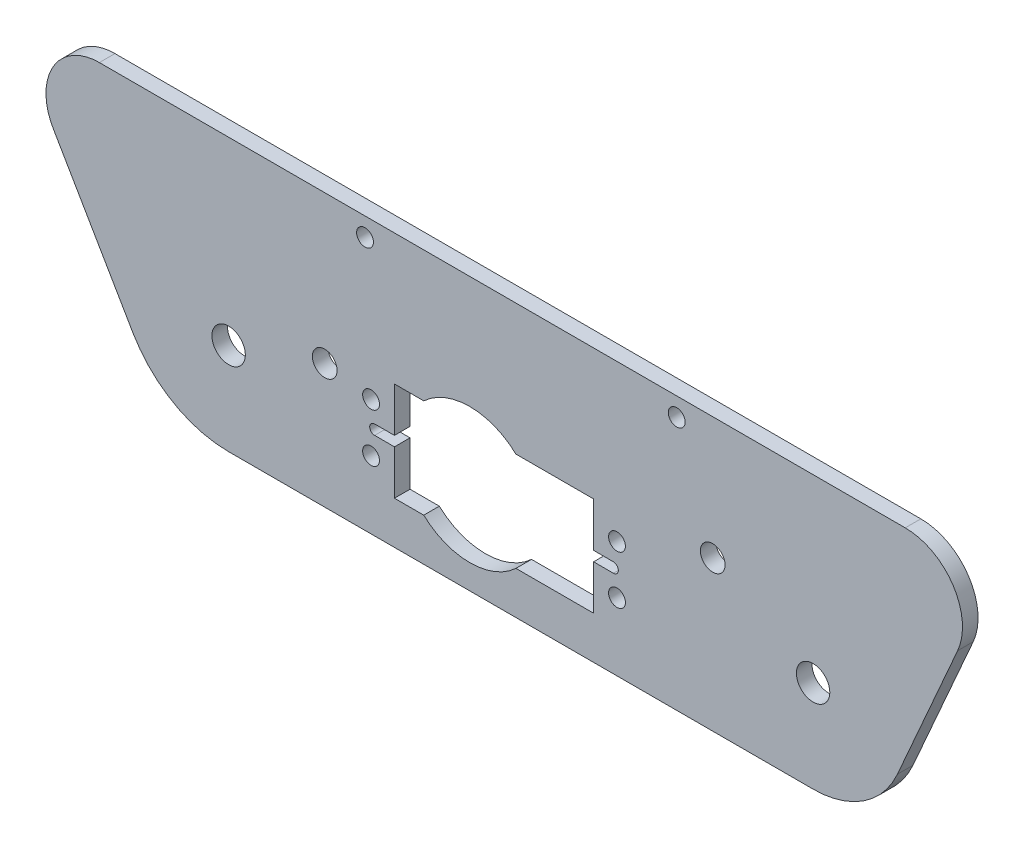
ISO-10303-21;
HEADER;
FILE_DESCRIPTION(('STEP AP214'),'2;1');
FILE_NAME('part.step','',(''),(''),'','','');
FILE_SCHEMA(('AUTOMOTIVE_DESIGN { 1 0 10303 214 1 1 1 1 }'));
ENDSEC;
DATA;
#1=APPLICATION_CONTEXT('core data for automotive mechanical design processes');
#2=APPLICATION_PROTOCOL_DEFINITION('international standard','automotive_design',2000,#1);
#3=PRODUCT_CONTEXT('',#1,'mechanical');
#4=PRODUCT('Part','Part','',(#3));
#5=PRODUCT_RELATED_PRODUCT_CATEGORY('part','',(#4));
#6=PRODUCT_DEFINITION_FORMATION('','',#4);
#7=PRODUCT_DEFINITION_CONTEXT('part definition',#1,'design');
#8=PRODUCT_DEFINITION('design','',#6,#7);
#9=PRODUCT_DEFINITION_SHAPE('','',#8);
#10=(LENGTH_UNIT() NAMED_UNIT(*) SI_UNIT(.MILLI.,.METRE.));
#11=(NAMED_UNIT(*) PLANE_ANGLE_UNIT() SI_UNIT($,.RADIAN.));
#12=(NAMED_UNIT(*) SI_UNIT($,.STERADIAN.) SOLID_ANGLE_UNIT());
#13=UNCERTAINTY_MEASURE_WITH_UNIT(LENGTH_MEASURE(1.E-05),#10,'distance_accuracy_value','');
#14=(GEOMETRIC_REPRESENTATION_CONTEXT(3) GLOBAL_UNCERTAINTY_ASSIGNED_CONTEXT((#13)) GLOBAL_UNIT_ASSIGNED_CONTEXT((#10,
#11,#12)) REPRESENTATION_CONTEXT('',''));
#15=CARTESIAN_POINT('',(0.,0.,0.));
#16=DIRECTION('',(0.,0.,1.));
#17=DIRECTION('',(1.,0.,0.));
#18=AXIS2_PLACEMENT_3D('',#15,#16,#17);
#19=CARTESIAN_POINT('',(74.943999972,29.06776,3.2004));
#20=DIRECTION('',(0.,1.,0.));
#21=DIRECTION('',(-1.,0.,0.));
#22=AXIS2_PLACEMENT_3D('',#19,#20,#21);
#23=PLANE('',#22);
#24=DIRECTION('',(1.,0.,0.));
#25=VECTOR('',#24,1.);
#26=CARTESIAN_POINT('',(74.943999972,29.06776,3.2004));
#27=LINE('',#26,#25);
#28=CARTESIAN_POINT('',(58.9943124104193,29.06776,3.2004));
#29=VERTEX_POINT('',#28);
#30=CARTESIAN_POINT('',(74.943999972,29.06776,3.2004));
#31=VERTEX_POINT('',#30);
#32=EDGE_CURVE('E236',#29,#31,#27,.T.);
#33=ORIENTED_EDGE('',*,*,#32,.F.);
#34=DIRECTION('',(0.,0.,-1.));
#35=VECTOR('',#34,1.);
#36=CARTESIAN_POINT('',(58.9943124104193,29.06776,42.4736794049101));
#37=LINE('',#36,#35);
#38=CARTESIAN_POINT('',(58.9943124104193,29.06776,0.));
#39=VERTEX_POINT('',#38);
#40=EDGE_CURVE('E201',#29,#39,#37,.T.);
#41=ORIENTED_EDGE('',*,*,#40,.T.);
#42=DIRECTION('',(1.,0.,0.));
#43=VECTOR('',#42,1.);
#44=CARTESIAN_POINT('',(74.943999972,29.06776,0.));
#45=LINE('',#44,#43);
#46=CARTESIAN_POINT('',(74.943999972,29.06776,0.));
#47=VERTEX_POINT('',#46);
#48=EDGE_CURVE('E211',#39,#47,#45,.T.);
#49=ORIENTED_EDGE('',*,*,#48,.T.);
#50=DIRECTION('',(0.,0.,-1.));
#51=VECTOR('',#50,1.);
#52=CARTESIAN_POINT('',(74.943999972,29.06776,3.2004));
#53=LINE('',#52,#51);
#54=EDGE_CURVE('E245',#31,#47,#53,.T.);
#55=ORIENTED_EDGE('',*,*,#54,.F.);
#56=EDGE_LOOP('',(#33,#41,#49,#55));
#57=FACE_BOUND('',#56,.T.);
#58=ADVANCED_FACE('F34',(#57),#23,.F.);
#59=CARTESIAN_POINT('',(74.943999972,8.74776000000003,3.2004));
#60=DIRECTION('',(0.,-1.,0.));
#61=DIRECTION('',(1.,0.,0.));
#62=AXIS2_PLACEMENT_3D('',#59,#60,#61);
#63=PLANE('',#62);
#64=DIRECTION('',(-1.,0.,0.));
#65=VECTOR('',#64,1.);
#66=CARTESIAN_POINT('',(74.943999972,8.74776000000003,3.2004));
#67=LINE('',#66,#65);
#68=CARTESIAN_POINT('',(40.0656875895807,8.74776000000002,3.2004));
#69=VERTEX_POINT('',#68);
#70=CARTESIAN_POINT('',(34.049999972,8.74776000000002,3.2004));
#71=VERTEX_POINT('',#70);
#72=EDGE_CURVE('E356',#69,#71,#67,.T.);
#73=ORIENTED_EDGE('',*,*,#72,.F.);
#74=DIRECTION('',(0.,0.,-1.));
#75=VECTOR('',#74,1.);
#76=CARTESIAN_POINT('',(40.0656875895807,8.74776000000002,42.4736794049101));
#77=LINE('',#76,#75);
#78=CARTESIAN_POINT('',(40.0656875895807,8.74776000000002,0.));
#79=VERTEX_POINT('',#78);
#80=EDGE_CURVE('E11',#69,#79,#77,.T.);
#81=ORIENTED_EDGE('',*,*,#80,.T.);
#82=DIRECTION('',(-1.,0.,0.));
#83=VECTOR('',#82,1.);
#84=CARTESIAN_POINT('',(74.943999972,8.74776000000003,0.));
#85=LINE('',#84,#83);
#86=CARTESIAN_POINT('',(34.049999972,8.74776000000002,0.));
#87=VERTEX_POINT('',#86);
#88=EDGE_CURVE('E228',#79,#87,#85,.T.);
#89=ORIENTED_EDGE('',*,*,#88,.T.);
#90=DIRECTION('',(0.,0.,-1.));
#91=VECTOR('',#90,1.);
#92=CARTESIAN_POINT('',(34.049999972,8.74776000000002,3.2004));
#93=LINE('',#92,#91);
#94=EDGE_CURVE('E239',#71,#87,#93,.T.);
#95=ORIENTED_EDGE('',*,*,#94,.F.);
#96=EDGE_LOOP('',(#73,#81,#89,#95));
#97=FACE_BOUND('',#96,.T.);
#98=ADVANCED_FACE('F460',(#97),#63,.F.);
#99=CARTESIAN_POINT('',(34.049999972,29.06776,3.2004));
#100=DIRECTION('',(-1.,0.,0.));
#101=DIRECTION('',(0.,-1.,0.));
#102=AXIS2_PLACEMENT_3D('',#99,#100,#101);
#103=PLANE('',#102);
#104=DIRECTION('',(0.,1.,0.));
#105=VECTOR('',#104,1.);
#106=CARTESIAN_POINT('',(34.049999972,29.06776,0.));
#107=LINE('',#106,#105);
#108=CARTESIAN_POINT('',(34.049999972,17.89176,0.));
#109=VERTEX_POINT('',#108);
#110=EDGE_CURVE('E233',#87,#109,#107,.T.);
#111=ORIENTED_EDGE('',*,*,#110,.T.);
#112=DIRECTION('',(0.,0.,1.));
#113=VECTOR('',#112,1.);
#114=CARTESIAN_POINT('',(34.049999972,17.89176,-5.47132744404866));
#115=LINE('',#114,#113);
#116=CARTESIAN_POINT('',(34.049999972,17.89176,3.2004));
#117=VERTEX_POINT('',#116);
#118=EDGE_CURVE('E420',#109,#117,#115,.T.);
#119=ORIENTED_EDGE('',*,*,#118,.T.);
#120=DIRECTION('',(0.,1.,0.));
#121=VECTOR('',#120,1.);
#122=CARTESIAN_POINT('',(34.049999972,29.06776,3.2004));
#123=LINE('',#122,#121);
#124=EDGE_CURVE('E224',#71,#117,#123,.T.);
#125=ORIENTED_EDGE('',*,*,#124,.F.);
#126=ORIENTED_EDGE('',*,*,#94,.T.);
#127=EDGE_LOOP('',(#111,#119,#125,#126));
#128=FACE_BOUND('',#127,.T.);
#129=ADVANCED_FACE('F467',(#128),#103,.F.);
#130=CARTESIAN_POINT('',(74.943999972,29.06776,3.2004));
#131=DIRECTION('',(1.,0.,0.));
#132=DIRECTION('',(0.,0.,-1.));
#133=AXIS2_PLACEMENT_3D('',#130,#131,#132);
#134=PLANE('',#133);
#135=DIRECTION('',(0.,-1.,0.));
#136=VECTOR('',#135,1.);
#137=CARTESIAN_POINT('',(74.943999972,29.06776,0.));
#138=LINE('',#137,#136);
#139=CARTESIAN_POINT('',(74.943999972,19.92376,0.));
#140=VERTEX_POINT('',#139);
#141=EDGE_CURVE('E220',#47,#140,#138,.T.);
#142=ORIENTED_EDGE('',*,*,#141,.T.);
#143=DIRECTION('',(0.,0.,1.));
#144=VECTOR('',#143,1.);
#145=CARTESIAN_POINT('',(74.943999972,19.92376,-5.47132744404866));
#146=LINE('',#145,#144);
#147=CARTESIAN_POINT('',(74.943999972,19.92376,3.2004));
#148=VERTEX_POINT('',#147);
#149=EDGE_CURVE('E398',#140,#148,#146,.T.);
#150=ORIENTED_EDGE('',*,*,#149,.T.);
#151=DIRECTION('',(0.,-1.,0.));
#152=VECTOR('',#151,1.);
#153=CARTESIAN_POINT('',(74.943999972,29.06776,3.2004));
#154=LINE('',#153,#152);
#155=EDGE_CURVE('E357',#31,#148,#154,.T.);
#156=ORIENTED_EDGE('',*,*,#155,.F.);
#157=ORIENTED_EDGE('',*,*,#54,.T.);
#158=EDGE_LOOP('',(#142,#150,#156,#157));
#159=FACE_BOUND('',#158,.T.);
#160=ADVANCED_FACE('F438',(#159),#134,.F.);
#161=CARTESIAN_POINT('',(-26.5432576602224,44.962934382464,3.2004));
#162=DIRECTION('',(0.,0.,1.));
#163=DIRECTION('',(1.,0.,0.));
#164=AXIS2_PLACEMENT_3D('',#161,#162,#163);
#165=PLANE('',#164);
#166=CARTESIAN_POINT('',(49.53,18.90776,3.2004));
#167=DIRECTION('',(0.,0.,1.));
#168=DIRECTION('',(1.,0.,0.));
#169=AXIS2_PLACEMENT_3D('',#166,#167,#168);
#170=CIRCLE('',#169,13.8852010933229);
#171=CARTESIAN_POINT('',(40.0656875895807,29.06776,3.2004));
#172=VERTEX_POINT('',#171);
#173=EDGE_CURVE('E49',#172,#29,#170,.F.);
#174=ORIENTED_EDGE('',*,*,#173,.T.);
#175=ORIENTED_EDGE('',*,*,#32,.T.);
#176=ORIENTED_EDGE('',*,*,#155,.T.);
#177=DIRECTION('',(-1.,0.,0.));
#178=VECTOR('',#177,1.);
#179=CARTESIAN_POINT('',(74.943999972,19.92376,3.2004));
#180=LINE('',#179,#178);
#181=CARTESIAN_POINT('',(79.007999972,19.92376,3.2004));
#182=VERTEX_POINT('',#181);
#183=EDGE_CURVE('E394',#182,#148,#180,.T.);
#184=ORIENTED_EDGE('',*,*,#183,.F.);
#185=CARTESIAN_POINT('',(79.007999972,18.90776,3.2004));
#186=DIRECTION('',(0.,0.,1.));
#187=DIRECTION('',(-1.,0.,0.));
#188=AXIS2_PLACEMENT_3D('',#185,#186,#187);
#189=CIRCLE('',#188,1.016);
#190=CARTESIAN_POINT('',(79.007999972,17.89176,3.2004));
#191=VERTEX_POINT('',#190);
#192=EDGE_CURVE('E403',#191,#182,#189,.T.);
#193=ORIENTED_EDGE('',*,*,#192,.F.);
#194=DIRECTION('',(1.,0.,0.));
#195=VECTOR('',#194,1.);
#196=CARTESIAN_POINT('',(74.943999972,17.89176,3.2004));
#197=LINE('',#196,#195);
#198=CARTESIAN_POINT('',(74.943999972,17.89176,3.2004));
#199=VERTEX_POINT('',#198);
#200=EDGE_CURVE('E406',#199,#191,#197,.T.);
#201=ORIENTED_EDGE('',*,*,#200,.F.);
#202=CARTESIAN_POINT('',(74.943999972,8.74776000000004,3.2004));
#203=VERTEX_POINT('',#202);
#204=EDGE_CURVE('E354',#199,#203,#154,.T.);
#205=ORIENTED_EDGE('',*,*,#204,.T.);
#206=CARTESIAN_POINT('',(58.9943124104193,8.74776000000002,3.2004));
#207=VERTEX_POINT('',#206);
#208=EDGE_CURVE('E344',#203,#207,#67,.T.);
#209=ORIENTED_EDGE('',*,*,#208,.T.);
#210=EDGE_CURVE('E57',#207,#69,#170,.F.);
#211=ORIENTED_EDGE('',*,*,#210,.T.);
#212=ORIENTED_EDGE('',*,*,#72,.T.);
#213=ORIENTED_EDGE('',*,*,#124,.T.);
#214=DIRECTION('',(1.,0.,0.));
#215=VECTOR('',#214,1.);
#216=CARTESIAN_POINT('',(29.985999972,17.89176,3.2004));
#217=LINE('',#216,#215);
#218=CARTESIAN_POINT('',(29.985999972,17.89176,3.2004));
#219=VERTEX_POINT('',#218);
#220=EDGE_CURVE('E416',#219,#117,#217,.T.);
#221=ORIENTED_EDGE('',*,*,#220,.F.);
#222=CARTESIAN_POINT('',(29.985999972,18.90776,3.2004));
#223=DIRECTION('',(0.,0.,1.));
#224=DIRECTION('',(1.,0.,0.));
#225=AXIS2_PLACEMENT_3D('',#222,#223,#224);
#226=CIRCLE('',#225,1.016);
#227=CARTESIAN_POINT('',(29.985999972,19.92376,3.2004));
#228=VERTEX_POINT('',#227);
#229=EDGE_CURVE('E425',#228,#219,#226,.T.);
#230=ORIENTED_EDGE('',*,*,#229,.F.);
#231=DIRECTION('',(-1.,0.,0.));
#232=VECTOR('',#231,1.);
#233=CARTESIAN_POINT('',(29.985999972,19.92376,3.2004));
#234=LINE('',#233,#232);
#235=CARTESIAN_POINT('',(34.049999972,19.92376,3.2004));
#236=VERTEX_POINT('',#235);
#237=EDGE_CURVE('E389',#236,#228,#234,.T.);
#238=ORIENTED_EDGE('',*,*,#237,.F.);
#239=CARTESIAN_POINT('',(34.049999972,29.06776,3.2004));
#240=VERTEX_POINT('',#239);
#241=EDGE_CURVE('E355',#236,#240,#123,.T.);
#242=ORIENTED_EDGE('',*,*,#241,.T.);
#243=EDGE_CURVE('E361',#240,#172,#27,.T.);
#244=ORIENTED_EDGE('',*,*,#243,.T.);
#245=EDGE_LOOP('',(#174,#175,#176,#184,#193,#201,#205,#209,#211,#212,#213,#221,#230,#238,#242,#244));
#246=FACE_BOUND('',#245,.T.);
#247=CARTESIAN_POINT('',(79.746999972,23.90776,3.2004));
#248=DIRECTION('',(0.,0.,-1.));
#249=DIRECTION('',(-1.,0.,0.));
#250=AXIS2_PLACEMENT_3D('',#247,#248,#249);
#251=CIRCLE('',#250,1.72719999999997);
#252=CARTESIAN_POINT('',(78.019799972,23.90776,3.2004));
#253=VERTEX_POINT('',#252);
#254=EDGE_CURVE('E222',#253,#253,#251,.T.);
#255=ORIENTED_EDGE('',*,*,#254,.T.);
#256=EDGE_LOOP('',(#255));
#257=FACE_BOUND('',#256,.T.);
#258=CARTESIAN_POINT('',(29.246999972,13.90776,3.2004));
#259=DIRECTION('',(0.,0.,-1.));
#260=DIRECTION('',(-1.,0.,0.));
#261=AXIS2_PLACEMENT_3D('',#258,#259,#260);
#262=CIRCLE('',#261,1.72720000000003);
#263=CARTESIAN_POINT('',(27.519799972,13.90776,3.2004));
#264=VERTEX_POINT('',#263);
#265=EDGE_CURVE('E366',#264,#264,#262,.T.);
#266=ORIENTED_EDGE('',*,*,#265,.T.);
#267=EDGE_LOOP('',(#266));
#268=FACE_BOUND('',#267,.T.);
#269=CARTESIAN_POINT('',(29.246999972,23.90776,3.2004));
#270=DIRECTION('',(0.,0.,-1.));
#271=DIRECTION('',(-1.,0.,0.));
#272=AXIS2_PLACEMENT_3D('',#269,#270,#271);
#273=CIRCLE('',#272,1.72720000000001);
#274=CARTESIAN_POINT('',(27.519799972,23.90776,3.2004));
#275=VERTEX_POINT('',#274);
#276=EDGE_CURVE('E367',#275,#275,#273,.T.);
#277=ORIENTED_EDGE('',*,*,#276,.T.);
#278=EDGE_LOOP('',(#277));
#279=FACE_BOUND('',#278,.T.);
#280=CARTESIAN_POINT('',(79.746999972,13.90776,3.2004));
#281=DIRECTION('',(0.,0.,-1.));
#282=DIRECTION('',(-1.,0.,0.));
#283=AXIS2_PLACEMENT_3D('',#280,#281,#282);
#284=CIRCLE('',#283,1.72720000000001);
#285=CARTESIAN_POINT('',(78.019799972,13.90776,3.2004));
#286=VERTEX_POINT('',#285);
#287=EDGE_CURVE('E378',#286,#286,#284,.T.);
#288=ORIENTED_EDGE('',*,*,#287,.T.);
#289=EDGE_LOOP('',(#288));
#290=FACE_BOUND('',#289,.T.);
#291=CARTESIAN_POINT('',(92.0115,52.1157199111664,3.2004));
#292=DIRECTION('',(0.,0.,-1.));
#293=DIRECTION('',(-1.,0.,0.));
#294=AXIS2_PLACEMENT_3D('',#291,#292,#293);
#295=CIRCLE('',#294,1.7272);
#296=CARTESIAN_POINT('',(90.2843,52.1157199111664,3.2004));
#297=VERTEX_POINT('',#296);
#298=EDGE_CURVE('E248',#297,#297,#295,.T.);
#299=ORIENTED_EDGE('',*,*,#298,.T.);
#300=EDGE_LOOP('',(#299));
#301=FACE_BOUND('',#300,.T.);
#302=CARTESIAN_POINT('',(28.0035,52.1157199111664,3.2004));
#303=DIRECTION('',(0.,0.,-1.));
#304=DIRECTION('',(-1.,0.,0.));
#305=AXIS2_PLACEMENT_3D('',#302,#303,#304);
#306=CIRCLE('',#305,1.7272);
#307=CARTESIAN_POINT('',(26.2763,52.1157199111664,3.2004));
#308=VERTEX_POINT('',#307);
#309=EDGE_CURVE('E255',#308,#308,#306,.T.);
#310=ORIENTED_EDGE('',*,*,#309,.T.);
#311=EDGE_LOOP('',(#310));
#312=FACE_BOUND('',#311,.T.);
#313=CARTESIAN_POINT('',(0.,18.90776,3.2004));
#314=DIRECTION('',(0.,0.,1.));
#315=DIRECTION('',(1.,0.,0.));
#316=AXIS2_PLACEMENT_3D('',#313,#314,#315);
#317=CIRCLE('',#316,3.429);
#318=CARTESIAN_POINT('',(3.429,18.90776,3.2004));
#319=VERTEX_POINT('',#318);
#320=EDGE_CURVE('E266',#319,#319,#317,.T.);
#321=ORIENTED_EDGE('',*,*,#320,.F.);
#322=EDGE_LOOP('',(#321));
#323=FACE_BOUND('',#322,.T.);
#324=CARTESIAN_POINT('',(19.734727625639,25.5664269922627,3.2004));
#325=DIRECTION('',(0.,0.,1.));
#326=DIRECTION('',(1.,0.,0.));
#327=AXIS2_PLACEMENT_3D('',#324,#325,#326);
#328=CIRCLE('',#327,2.54);
#329=CARTESIAN_POINT('',(22.274727625639,25.5664269922627,3.2004));
#330=VERTEX_POINT('',#329);
#331=EDGE_CURVE('E278',#330,#330,#328,.T.);
#332=ORIENTED_EDGE('',*,*,#331,.F.);
#333=EDGE_LOOP('',(#332));
#334=FACE_BOUND('',#333,.T.);
#335=CARTESIAN_POINT('',(-26.5432576602224,44.962934382464,3.2004));
#336=DIRECTION('',(0.,0.,1.));
#337=DIRECTION('',(1.,0.,0.));
#338=AXIS2_PLACEMENT_3D('',#335,#336,#337);
#339=CIRCLE('',#338,10.9627855287024);
#340=CARTESIAN_POINT('',(-26.5432576602224,55.9257199111664,3.2004));
#341=VERTEX_POINT('',#340);
#342=CARTESIAN_POINT('',(-36.0198012287958,39.4513294854074,3.2004));
#343=VERTEX_POINT('',#342);
#344=EDGE_CURVE('E284',#341,#343,#339,.T.);
#345=ORIENTED_EDGE('',*,*,#344,.T.);
#346=DIRECTION('',(0.502755881032815,-0.864428437805535,0.));
#347=VECTOR('',#346,1.);
#348=CARTESIAN_POINT('',(-36.0198012287958,39.4513294854074,3.2004));
#349=LINE('',#348,#347);
#350=CARTESIAN_POINT('',(-19.6480998710094,11.302152592922,3.2004));
#351=VERTEX_POINT('',#350);
#352=EDGE_CURVE('E287',#343,#351,#349,.T.);
#353=ORIENTED_EDGE('',*,*,#352,.T.);
#354=CARTESIAN_POINT('',(0.,22.7295852516013,3.2004));
#355=DIRECTION('',(0.,0.,1.));
#356=DIRECTION('',(1.,0.,0.));
#357=AXIS2_PLACEMENT_3D('',#354,#355,#356);
#358=CIRCLE('',#357,22.7295852516013);
#359=CARTESIAN_POINT('',(0.,0.,3.2004));
#360=VERTEX_POINT('',#359);
#361=EDGE_CURVE('E290',#351,#360,#358,.T.);
#362=ORIENTED_EDGE('',*,*,#361,.T.);
#363=DIRECTION('',(1.,0.,0.));
#364=VECTOR('',#363,1.);
#365=CARTESIAN_POINT('',(0.,0.,3.2004));
#366=LINE('',#365,#364);
#367=CARTESIAN_POINT('',(120.015,0.,3.2004));
#368=VERTEX_POINT('',#367);
#369=EDGE_CURVE('E292',#360,#368,#366,.T.);
#370=ORIENTED_EDGE('',*,*,#369,.T.);
#371=CARTESIAN_POINT('',(120.015,18.90776,3.2004));
#372=DIRECTION('',(0.,0.,1.));
#373=DIRECTION('',(-1.,0.,0.));
#374=AXIS2_PLACEMENT_3D('',#371,#372,#373);
#375=CIRCLE('',#374,18.90776);
#376=CARTESIAN_POINT('',(137.325636157779,11.302152592922,3.2004));
#377=VERTEX_POINT('',#376);
#378=EDGE_CURVE('E294',#368,#377,#375,.T.);
#379=ORIENTED_EDGE('',*,*,#378,.T.);
#380=DIRECTION('',(0.402247934555864,0.91553077454859,0.));
#381=VECTOR('',#380,1.);
#382=CARTESIAN_POINT('',(149.693268769618,39.4513294854073,3.2004));
#383=LINE('',#382,#381);
#384=CARTESIAN_POINT('',(149.693268769618,39.4513294854073,3.2004));
#385=VERTEX_POINT('',#384);
#386=EDGE_CURVE('E296',#377,#385,#383,.T.);
#387=ORIENTED_EDGE('',*,*,#386,.T.);
#388=CARTESIAN_POINT('',(138.937102862704,44.1771624558281,3.2004));
#389=DIRECTION('',(0.,0.,1.));
#390=DIRECTION('',(-1.,0.,0.));
#391=AXIS2_PLACEMENT_3D('',#388,#389,#390);
#392=CIRCLE('',#391,11.7485574553383);
#393=CARTESIAN_POINT('',(138.937102862704,55.9257199111664,3.2004));
#394=VERTEX_POINT('',#393);
#395=EDGE_CURVE('E298',#385,#394,#392,.T.);
#396=ORIENTED_EDGE('',*,*,#395,.T.);
#397=DIRECTION('',(-1.,0.,0.));
#398=VECTOR('',#397,1.);
#399=CARTESIAN_POINT('',(138.937102862704,55.9257199111664,3.2004));
#400=LINE('',#399,#398);
#401=EDGE_CURVE('E300',#394,#341,#400,.T.);
#402=ORIENTED_EDGE('',*,*,#401,.T.);
#403=EDGE_LOOP('',(#345,#353,#362,#370,#379,#387,#396,#402));
#404=FACE_BOUND('',#403,.T.);
#405=CARTESIAN_POINT('',(120.015,18.90776,3.2004));
#406=DIRECTION('',(0.,0.,1.));
#407=DIRECTION('',(1.,0.,0.));
#408=AXIS2_PLACEMENT_3D('',#405,#406,#407);
#409=CIRCLE('',#408,3.429);
#410=CARTESIAN_POINT('',(123.444,18.90776,3.2004));
#411=VERTEX_POINT('',#410);
#412=EDGE_CURVE('E272',#411,#411,#409,.T.);
#413=ORIENTED_EDGE('',*,*,#412,.F.);
#414=EDGE_LOOP('',(#413));
#415=FACE_BOUND('',#414,.T.);
#416=CARTESIAN_POINT('',(99.4008225307399,30.8093609109999,3.2004));
#417=DIRECTION('',(0.,0.,1.));
#418=DIRECTION('',(1.,0.,0.));
#419=AXIS2_PLACEMENT_3D('',#416,#417,#418);
#420=CIRCLE('',#419,2.54);
#421=CARTESIAN_POINT('',(101.94082253074,30.8093609109999,3.2004));
#422=VERTEX_POINT('',#421);
#423=EDGE_CURVE('E260',#422,#422,#420,.T.);
#424=ORIENTED_EDGE('',*,*,#423,.F.);
#425=EDGE_LOOP('',(#424));
#426=FACE_BOUND('',#425,.T.);
#427=ADVANCED_FACE('F349',(#246,#257,#268,#279,#290,#301,#312,#323,#334,#404,#415,#426),#165,.T.);
#428=CARTESIAN_POINT('',(-26.5432576602224,44.962934382464,0.));
#429=DIRECTION('',(0.,0.,1.));
#430=DIRECTION('',(1.,0.,0.));
#431=AXIS2_PLACEMENT_3D('',#428,#429,#430);
#432=PLANE('',#431);
#433=CARTESIAN_POINT('',(79.746999972,23.90776,0.));
#434=DIRECTION('',(0.,0.,-1.));
#435=DIRECTION('',(-1.,0.,0.));
#436=AXIS2_PLACEMENT_3D('',#433,#434,#435);
#437=CIRCLE('',#436,1.72719999999997);
#438=CARTESIAN_POINT('',(78.019799972,23.90776,0.));
#439=VERTEX_POINT('',#438);
#440=EDGE_CURVE('E370',#439,#439,#437,.T.);
#441=ORIENTED_EDGE('',*,*,#440,.F.);
#442=EDGE_LOOP('',(#441));
#443=FACE_BOUND('',#442,.T.);
#444=CARTESIAN_POINT('',(29.246999972,13.90776,0.));
#445=DIRECTION('',(0.,0.,-1.));
#446=DIRECTION('',(-1.,0.,0.));
#447=AXIS2_PLACEMENT_3D('',#444,#445,#446);
#448=CIRCLE('',#447,1.72720000000003);
#449=CARTESIAN_POINT('',(27.519799972,13.90776,0.));
#450=VERTEX_POINT('',#449);
#451=EDGE_CURVE('E363',#450,#450,#448,.T.);
#452=ORIENTED_EDGE('',*,*,#451,.F.);
#453=EDGE_LOOP('',(#452));
#454=FACE_BOUND('',#453,.T.);
#455=CARTESIAN_POINT('',(29.246999972,23.90776,0.));
#456=DIRECTION('',(0.,0.,-1.));
#457=DIRECTION('',(-1.,0.,0.));
#458=AXIS2_PLACEMENT_3D('',#455,#456,#457);
#459=CIRCLE('',#458,1.72720000000001);
#460=CARTESIAN_POINT('',(27.519799972,23.90776,0.));
#461=VERTEX_POINT('',#460);
#462=EDGE_CURVE('E382',#461,#461,#459,.T.);
#463=ORIENTED_EDGE('',*,*,#462,.F.);
#464=EDGE_LOOP('',(#463));
#465=FACE_BOUND('',#464,.T.);
#466=CARTESIAN_POINT('',(79.746999972,13.90776,0.));
#467=DIRECTION('',(0.,0.,-1.));
#468=DIRECTION('',(-1.,0.,0.));
#469=AXIS2_PLACEMENT_3D('',#466,#467,#468);
#470=CIRCLE('',#469,1.72720000000001);
#471=CARTESIAN_POINT('',(78.019799972,13.90776,0.));
#472=VERTEX_POINT('',#471);
#473=EDGE_CURVE('E375',#472,#472,#470,.T.);
#474=ORIENTED_EDGE('',*,*,#473,.F.);
#475=EDGE_LOOP('',(#474));
#476=FACE_BOUND('',#475,.T.);
#477=ORIENTED_EDGE('',*,*,#48,.F.);
#478=CARTESIAN_POINT('',(49.53,18.90776,0.));
#479=DIRECTION('',(0.,0.,-1.));
#480=DIRECTION('',(-1.,0.,0.));
#481=AXIS2_PLACEMENT_3D('',#478,#479,#480);
#482=CIRCLE('',#481,13.8852010933229);
#483=CARTESIAN_POINT('',(40.0656875895807,29.06776,0.));
#484=VERTEX_POINT('',#483);
#485=EDGE_CURVE('E195',#484,#39,#482,.T.);
#486=ORIENTED_EDGE('',*,*,#485,.F.);
#487=CARTESIAN_POINT('',(34.049999972,29.06776,0.));
#488=VERTEX_POINT('',#487);
#489=EDGE_CURVE('E209',#488,#484,#45,.T.);
#490=ORIENTED_EDGE('',*,*,#489,.F.);
#491=CARTESIAN_POINT('',(34.049999972,19.92376,0.));
#492=VERTEX_POINT('',#491);
#493=EDGE_CURVE('E232',#492,#488,#107,.T.);
#494=ORIENTED_EDGE('',*,*,#493,.F.);
#495=DIRECTION('',(1.,0.,0.));
#496=VECTOR('',#495,1.);
#497=CARTESIAN_POINT('',(29.985999972,19.92376,0.));
#498=LINE('',#497,#496);
#499=CARTESIAN_POINT('',(29.985999972,19.92376,0.));
#500=VERTEX_POINT('',#499);
#501=EDGE_CURVE('E379',#500,#492,#498,.T.);
#502=ORIENTED_EDGE('',*,*,#501,.F.);
#503=CARTESIAN_POINT('',(29.985999972,18.90776,0.));
#504=DIRECTION('',(0.,0.,1.));
#505=DIRECTION('',(1.,0.,0.));
#506=AXIS2_PLACEMENT_3D('',#503,#504,#505);
#507=CIRCLE('',#506,1.016);
#508=CARTESIAN_POINT('',(29.985999972,17.89176,0.));
#509=VERTEX_POINT('',#508);
#510=EDGE_CURVE('E423',#509,#500,#507,.F.);
#511=ORIENTED_EDGE('',*,*,#510,.F.);
#512=DIRECTION('',(-1.,0.,0.));
#513=VECTOR('',#512,1.);
#514=CARTESIAN_POINT('',(29.985999972,17.89176,0.));
#515=LINE('',#514,#513);
#516=EDGE_CURVE('E412',#109,#509,#515,.T.);
#517=ORIENTED_EDGE('',*,*,#516,.F.);
#518=ORIENTED_EDGE('',*,*,#110,.F.);
#519=ORIENTED_EDGE('',*,*,#88,.F.);
#520=CARTESIAN_POINT('',(58.9943124104193,8.74776000000003,0.));
#521=VERTEX_POINT('',#520);
#522=EDGE_CURVE('E212',#521,#79,#482,.T.);
#523=ORIENTED_EDGE('',*,*,#522,.F.);
#524=CARTESIAN_POINT('',(74.943999972,8.74776000000003,0.));
#525=VERTEX_POINT('',#524);
#526=EDGE_CURVE('E229',#525,#521,#85,.T.);
#527=ORIENTED_EDGE('',*,*,#526,.F.);
#528=CARTESIAN_POINT('',(74.943999972,17.89176,0.));
#529=VERTEX_POINT('',#528);
#530=EDGE_CURVE('E218',#529,#525,#138,.T.);
#531=ORIENTED_EDGE('',*,*,#530,.F.);
#532=DIRECTION('',(-1.,0.,0.));
#533=VECTOR('',#532,1.);
#534=CARTESIAN_POINT('',(74.943999972,17.89176,0.));
#535=LINE('',#534,#533);
#536=CARTESIAN_POINT('',(79.007999972,17.89176,0.));
#537=VERTEX_POINT('',#536);
#538=EDGE_CURVE('E387',#537,#529,#535,.T.);
#539=ORIENTED_EDGE('',*,*,#538,.F.);
#540=CARTESIAN_POINT('',(79.007999972,18.90776,0.));
#541=DIRECTION('',(0.,0.,1.));
#542=DIRECTION('',(1.,0.,0.));
#543=AXIS2_PLACEMENT_3D('',#540,#541,#542);
#544=CIRCLE('',#543,1.016);
#545=CARTESIAN_POINT('',(79.007999972,19.92376,0.));
#546=VERTEX_POINT('',#545);
#547=EDGE_CURVE('E401',#546,#537,#544,.F.);
#548=ORIENTED_EDGE('',*,*,#547,.F.);
#549=DIRECTION('',(1.,0.,0.));
#550=VECTOR('',#549,1.);
#551=CARTESIAN_POINT('',(74.943999972,19.92376,0.));
#552=LINE('',#551,#550);
#553=EDGE_CURVE('E390',#140,#546,#552,.T.);
#554=ORIENTED_EDGE('',*,*,#553,.F.);
#555=ORIENTED_EDGE('',*,*,#141,.F.);
#556=EDGE_LOOP('',(#477,#486,#490,#494,#502,#511,#517,#518,#519,#523,#527,#531,#539,#548,#554,#555));
#557=FACE_BOUND('',#556,.T.);
#558=CARTESIAN_POINT('',(92.0115,52.1157199111664,0.));
#559=DIRECTION('',(0.,0.,-1.));
#560=DIRECTION('',(-1.,0.,0.));
#561=AXIS2_PLACEMENT_3D('',#558,#559,#560);
#562=CIRCLE('',#561,1.7272);
#563=CARTESIAN_POINT('',(90.2843,52.1157199111664,0.));
#564=VERTEX_POINT('',#563);
#565=EDGE_CURVE('E252',#564,#564,#562,.T.);
#566=ORIENTED_EDGE('',*,*,#565,.F.);
#567=EDGE_LOOP('',(#566));
#568=FACE_BOUND('',#567,.T.);
#569=CARTESIAN_POINT('',(28.0035,52.1157199111664,0.));
#570=DIRECTION('',(0.,0.,-1.));
#571=DIRECTION('',(-1.,0.,0.));
#572=AXIS2_PLACEMENT_3D('',#569,#570,#571);
#573=CIRCLE('',#572,1.7272);
#574=CARTESIAN_POINT('',(26.2763,52.1157199111664,0.));
#575=VERTEX_POINT('',#574);
#576=EDGE_CURVE('E238',#575,#575,#573,.T.);
#577=ORIENTED_EDGE('',*,*,#576,.F.);
#578=EDGE_LOOP('',(#577));
#579=FACE_BOUND('',#578,.T.);
#580=CARTESIAN_POINT('',(-26.5432576602224,44.962934382464,0.));
#581=DIRECTION('',(0.,0.,1.));
#582=DIRECTION('',(1.,0.,0.));
#583=AXIS2_PLACEMENT_3D('',#580,#581,#582);
#584=CIRCLE('',#583,10.9627855287024);
#585=CARTESIAN_POINT('',(-26.5432576602224,55.9257199111664,0.));
#586=VERTEX_POINT('',#585);
#587=CARTESIAN_POINT('',(-36.0198012287958,39.4513294854074,0.));
#588=VERTEX_POINT('',#587);
#589=EDGE_CURVE('E281',#586,#588,#584,.T.);
#590=ORIENTED_EDGE('',*,*,#589,.F.);
#591=DIRECTION('',(-1.,0.,0.));
#592=VECTOR('',#591,1.);
#593=CARTESIAN_POINT('',(138.937102862704,55.9257199111664,0.));
#594=LINE('',#593,#592);
#595=CARTESIAN_POINT('',(138.937102862704,55.9257199111664,0.));
#596=VERTEX_POINT('',#595);
#597=EDGE_CURVE('E288',#596,#586,#594,.T.);
#598=ORIENTED_EDGE('',*,*,#597,.F.);
#599=CARTESIAN_POINT('',(138.937102862704,44.1771624558281,0.));
#600=DIRECTION('',(0.,0.,1.));
#601=DIRECTION('',(-1.,0.,0.));
#602=AXIS2_PLACEMENT_3D('',#599,#600,#601);
#603=CIRCLE('',#602,11.7485574553383);
#604=CARTESIAN_POINT('',(149.693268769618,39.4513294854073,0.));
#605=VERTEX_POINT('',#604);
#606=EDGE_CURVE('E315',#605,#596,#603,.T.);
#607=ORIENTED_EDGE('',*,*,#606,.F.);
#608=DIRECTION('',(0.402247934555864,0.91553077454859,0.));
#609=VECTOR('',#608,1.);
#610=CARTESIAN_POINT('',(149.693268769618,39.4513294854073,0.));
#611=LINE('',#610,#609);
#612=CARTESIAN_POINT('',(137.325636157779,11.302152592922,0.));
#613=VERTEX_POINT('',#612);
#614=EDGE_CURVE('E313',#613,#605,#611,.T.);
#615=ORIENTED_EDGE('',*,*,#614,.F.);
#616=CARTESIAN_POINT('',(120.015,18.90776,0.));
#617=DIRECTION('',(0.,0.,1.));
#618=DIRECTION('',(-1.,0.,0.));
#619=AXIS2_PLACEMENT_3D('',#616,#617,#618);
#620=CIRCLE('',#619,18.90776);
#621=CARTESIAN_POINT('',(120.015,0.,0.));
#622=VERTEX_POINT('',#621);
#623=EDGE_CURVE('E311',#622,#613,#620,.T.);
#624=ORIENTED_EDGE('',*,*,#623,.F.);
#625=DIRECTION('',(1.,0.,0.));
#626=VECTOR('',#625,1.);
#627=CARTESIAN_POINT('',(0.,0.,0.));
#628=LINE('',#627,#626);
#629=CARTESIAN_POINT('',(0.,0.,0.));
#630=VERTEX_POINT('',#629);
#631=EDGE_CURVE('E309',#630,#622,#628,.T.);
#632=ORIENTED_EDGE('',*,*,#631,.F.);
#633=CARTESIAN_POINT('',(0.,22.7295852516013,0.));
#634=DIRECTION('',(0.,0.,1.));
#635=DIRECTION('',(1.,0.,0.));
#636=AXIS2_PLACEMENT_3D('',#633,#634,#635);
#637=CIRCLE('',#636,22.7295852516013);
#638=CARTESIAN_POINT('',(-19.6480998710094,11.302152592922,0.));
#639=VERTEX_POINT('',#638);
#640=EDGE_CURVE('E307',#639,#630,#637,.T.);
#641=ORIENTED_EDGE('',*,*,#640,.F.);
#642=DIRECTION('',(0.502755881032815,-0.864428437805535,0.));
#643=VECTOR('',#642,1.);
#644=CARTESIAN_POINT('',(-36.0198012287958,39.4513294854074,0.));
#645=LINE('',#644,#643);
#646=EDGE_CURVE('E305',#588,#639,#645,.T.);
#647=ORIENTED_EDGE('',*,*,#646,.F.);
#648=EDGE_LOOP('',(#590,#598,#607,#615,#624,#632,#641,#647));
#649=FACE_BOUND('',#648,.T.);
#650=CARTESIAN_POINT('',(19.734727625639,25.5664269922627,0.));
#651=DIRECTION('',(0.,0.,1.));
#652=DIRECTION('',(1.,0.,0.));
#653=AXIS2_PLACEMENT_3D('',#650,#651,#652);
#654=CIRCLE('',#653,2.54);
#655=CARTESIAN_POINT('',(22.274727625639,25.5664269922627,0.));
#656=VERTEX_POINT('',#655);
#657=EDGE_CURVE('E275',#656,#656,#654,.T.);
#658=ORIENTED_EDGE('',*,*,#657,.T.);
#659=EDGE_LOOP('',(#658));
#660=FACE_BOUND('',#659,.T.);
#661=CARTESIAN_POINT('',(120.015,18.90776,0.));
#662=DIRECTION('',(0.,0.,1.));
#663=DIRECTION('',(1.,0.,0.));
#664=AXIS2_PLACEMENT_3D('',#661,#662,#663);
#665=CIRCLE('',#664,3.429);
#666=CARTESIAN_POINT('',(123.444,18.90776,0.));
#667=VERTEX_POINT('',#666);
#668=EDGE_CURVE('E269',#667,#667,#665,.T.);
#669=ORIENTED_EDGE('',*,*,#668,.T.);
#670=EDGE_LOOP('',(#669));
#671=FACE_BOUND('',#670,.T.);
#672=CARTESIAN_POINT('',(0.,18.90776,0.));
#673=DIRECTION('',(0.,0.,1.));
#674=DIRECTION('',(1.,0.,0.));
#675=AXIS2_PLACEMENT_3D('',#672,#673,#674);
#676=CIRCLE('',#675,3.429);
#677=CARTESIAN_POINT('',(3.429,18.90776,0.));
#678=VERTEX_POINT('',#677);
#679=EDGE_CURVE('E263',#678,#678,#676,.T.);
#680=ORIENTED_EDGE('',*,*,#679,.T.);
#681=EDGE_LOOP('',(#680));
#682=FACE_BOUND('',#681,.T.);
#683=CARTESIAN_POINT('',(99.4008225307399,30.8093609109999,0.));
#684=DIRECTION('',(0.,0.,1.));
#685=DIRECTION('',(1.,0.,0.));
#686=AXIS2_PLACEMENT_3D('',#683,#684,#685);
#687=CIRCLE('',#686,2.54);
#688=CARTESIAN_POINT('',(101.94082253074,30.8093609109999,0.));
#689=VERTEX_POINT('',#688);
#690=EDGE_CURVE('E251',#689,#689,#687,.T.);
#691=ORIENTED_EDGE('',*,*,#690,.T.);
#692=EDGE_LOOP('',(#691));
#693=FACE_BOUND('',#692,.T.);
#694=ADVANCED_FACE('F206',(#443,#454,#465,#476,#557,#568,#579,#649,#660,#671,#682,#693),#432,.F.);
#695=CARTESIAN_POINT('',(-26.5432576602224,44.962934382464,3.2004));
#696=DIRECTION('',(0.,0.,-1.));
#697=DIRECTION('',(-1.,0.,0.));
#698=AXIS2_PLACEMENT_3D('',#695,#696,#697);
#699=CYLINDRICAL_SURFACE('',#698,10.9627855287024);
#700=ORIENTED_EDGE('',*,*,#589,.T.);
#701=DIRECTION('',(0.,0.,-1.));
#702=VECTOR('',#701,1.);
#703=CARTESIAN_POINT('',(-36.0198012287958,39.4513294854074,3.2004));
#704=LINE('',#703,#702);
#705=EDGE_CURVE('E338',#343,#588,#704,.T.);
#706=ORIENTED_EDGE('',*,*,#705,.F.);
#707=ORIENTED_EDGE('',*,*,#344,.F.);
#708=DIRECTION('',(0.,0.,-1.));
#709=VECTOR('',#708,1.);
#710=CARTESIAN_POINT('',(-26.5432576602224,55.9257199111664,3.2004));
#711=LINE('',#710,#709);
#712=EDGE_CURVE('E302',#341,#586,#711,.T.);
#713=ORIENTED_EDGE('',*,*,#712,.T.);
#714=EDGE_LOOP('',(#700,#706,#707,#713));
#715=FACE_BOUND('',#714,.T.);
#716=ADVANCED_FACE('F36',(#715),#699,.T.);
#717=CARTESIAN_POINT('',(-36.0198012287958,39.4513294854074,3.2004));
#718=DIRECTION('',(0.864428437805535,0.502755881032815,0.));
#719=DIRECTION('',(-0.502755881032815,0.864428437805535,0.));
#720=AXIS2_PLACEMENT_3D('',#717,#718,#719);
#721=PLANE('',#720);
#722=ORIENTED_EDGE('',*,*,#646,.T.);
#723=DIRECTION('',(0.,0.,-1.));
#724=VECTOR('',#723,1.);
#725=CARTESIAN_POINT('',(-19.6480998710094,11.302152592922,3.2004));
#726=LINE('',#725,#724);
#727=EDGE_CURVE('E335',#351,#639,#726,.T.);
#728=ORIENTED_EDGE('',*,*,#727,.F.);
#729=ORIENTED_EDGE('',*,*,#352,.F.);
#730=ORIENTED_EDGE('',*,*,#705,.T.);
#731=EDGE_LOOP('',(#722,#728,#729,#730));
#732=FACE_BOUND('',#731,.T.);
#733=ADVANCED_FACE('F551',(#732),#721,.F.);
#734=CARTESIAN_POINT('',(0.,22.7295852516013,3.2004));
#735=DIRECTION('',(0.,0.,-1.));
#736=DIRECTION('',(-1.,0.,0.));
#737=AXIS2_PLACEMENT_3D('',#734,#735,#736);
#738=CYLINDRICAL_SURFACE('',#737,22.7295852516013);
#739=ORIENTED_EDGE('',*,*,#640,.T.);
#740=DIRECTION('',(0.,0.,-1.));
#741=VECTOR('',#740,1.);
#742=CARTESIAN_POINT('',(0.,0.,3.2004));
#743=LINE('',#742,#741);
#744=EDGE_CURVE('E332',#360,#630,#743,.T.);
#745=ORIENTED_EDGE('',*,*,#744,.F.);
#746=ORIENTED_EDGE('',*,*,#361,.F.);
#747=ORIENTED_EDGE('',*,*,#727,.T.);
#748=EDGE_LOOP('',(#739,#745,#746,#747));
#749=FACE_BOUND('',#748,.T.);
#750=ADVANCED_FACE('F548',(#749),#738,.T.);
#751=CARTESIAN_POINT('',(0.,0.,3.2004));
#752=DIRECTION('',(0.,1.,0.));
#753=DIRECTION('',(-1.,0.,0.));
#754=AXIS2_PLACEMENT_3D('',#751,#752,#753);
#755=PLANE('',#754);
#756=ORIENTED_EDGE('',*,*,#631,.T.);
#757=DIRECTION('',(0.,0.,-1.));
#758=VECTOR('',#757,1.);
#759=CARTESIAN_POINT('',(120.015,0.,3.2004));
#760=LINE('',#759,#758);
#761=EDGE_CURVE('E329',#368,#622,#760,.T.);
#762=ORIENTED_EDGE('',*,*,#761,.F.);
#763=ORIENTED_EDGE('',*,*,#369,.F.);
#764=ORIENTED_EDGE('',*,*,#744,.T.);
#765=EDGE_LOOP('',(#756,#762,#763,#764));
#766=FACE_BOUND('',#765,.T.);
#767=ADVANCED_FACE('F544',(#766),#755,.F.);
#768=CARTESIAN_POINT('',(120.015,18.90776,3.2004));
#769=DIRECTION('',(0.,0.,-1.));
#770=DIRECTION('',(-1.,0.,0.));
#771=AXIS2_PLACEMENT_3D('',#768,#769,#770);
#772=CYLINDRICAL_SURFACE('',#771,18.90776);
#773=ORIENTED_EDGE('',*,*,#623,.T.);
#774=DIRECTION('',(0.,0.,-1.));
#775=VECTOR('',#774,1.);
#776=CARTESIAN_POINT('',(137.325636157779,11.302152592922,3.2004));
#777=LINE('',#776,#775);
#778=EDGE_CURVE('E326',#377,#613,#777,.T.);
#779=ORIENTED_EDGE('',*,*,#778,.F.);
#780=ORIENTED_EDGE('',*,*,#378,.F.);
#781=ORIENTED_EDGE('',*,*,#761,.T.);
#782=EDGE_LOOP('',(#773,#779,#780,#781));
#783=FACE_BOUND('',#782,.T.);
#784=ADVANCED_FACE('F540',(#783),#772,.T.);
#785=CARTESIAN_POINT('',(149.693268769618,39.4513294854073,3.2004));
#786=DIRECTION('',(-0.91553077454859,0.402247934555864,0.));
#787=DIRECTION('',(-0.402247934555864,-0.91553077454859,0.));
#788=AXIS2_PLACEMENT_3D('',#785,#786,#787);
#789=PLANE('',#788);
#790=ORIENTED_EDGE('',*,*,#614,.T.);
#791=DIRECTION('',(0.,0.,-1.));
#792=VECTOR('',#791,1.);
#793=CARTESIAN_POINT('',(149.693268769618,39.4513294854073,3.2004));
#794=LINE('',#793,#792);
#795=EDGE_CURVE('E323',#385,#605,#794,.T.);
#796=ORIENTED_EDGE('',*,*,#795,.F.);
#797=ORIENTED_EDGE('',*,*,#386,.F.);
#798=ORIENTED_EDGE('',*,*,#778,.T.);
#799=EDGE_LOOP('',(#790,#796,#797,#798));
#800=FACE_BOUND('',#799,.T.);
#801=ADVANCED_FACE('F536',(#800),#789,.F.);
#802=CARTESIAN_POINT('',(138.937102862704,44.1771624558281,3.2004));
#803=DIRECTION('',(0.,0.,-1.));
#804=DIRECTION('',(-1.,0.,0.));
#805=AXIS2_PLACEMENT_3D('',#802,#803,#804);
#806=CYLINDRICAL_SURFACE('',#805,11.7485574553383);
#807=ORIENTED_EDGE('',*,*,#606,.T.);
#808=DIRECTION('',(0.,0.,-1.));
#809=VECTOR('',#808,1.);
#810=CARTESIAN_POINT('',(138.937102862704,55.9257199111664,3.2004));
#811=LINE('',#810,#809);
#812=EDGE_CURVE('E320',#394,#596,#811,.T.);
#813=ORIENTED_EDGE('',*,*,#812,.F.);
#814=ORIENTED_EDGE('',*,*,#395,.F.);
#815=ORIENTED_EDGE('',*,*,#795,.T.);
#816=EDGE_LOOP('',(#807,#813,#814,#815));
#817=FACE_BOUND('',#816,.T.);
#818=ADVANCED_FACE('F532',(#817),#806,.T.);
#819=CARTESIAN_POINT('',(138.937102862704,55.9257199111664,3.2004));
#820=DIRECTION('',(0.,-1.,0.));
#821=DIRECTION('',(1.,0.,0.));
#822=AXIS2_PLACEMENT_3D('',#819,#820,#821);
#823=PLANE('',#822);
#824=ORIENTED_EDGE('',*,*,#597,.T.);
#825=ORIENTED_EDGE('',*,*,#712,.F.);
#826=ORIENTED_EDGE('',*,*,#401,.F.);
#827=ORIENTED_EDGE('',*,*,#812,.T.);
#828=EDGE_LOOP('',(#824,#825,#826,#827));
#829=FACE_BOUND('',#828,.T.);
#830=ADVANCED_FACE('F523',(#829),#823,.F.);
#831=CARTESIAN_POINT('',(19.734727625639,25.5664269922627,3.2004));
#832=DIRECTION('',(0.,0.,-1.));
#833=DIRECTION('',(-1.,0.,0.));
#834=AXIS2_PLACEMENT_3D('',#831,#832,#833);
#835=CYLINDRICAL_SURFACE('',#834,2.54);
#836=ORIENTED_EDGE('',*,*,#331,.T.);
#837=EDGE_LOOP('',(#836));
#838=FACE_BOUND('',#837,.T.);
#839=ORIENTED_EDGE('',*,*,#657,.F.);
#840=EDGE_LOOP('',(#839));
#841=FACE_BOUND('',#840,.T.);
#842=ADVANCED_FACE('F519',(#838,#841),#835,.F.);
#843=CARTESIAN_POINT('',(120.015,18.90776,3.2004));
#844=DIRECTION('',(0.,0.,-1.));
#845=DIRECTION('',(-1.,0.,0.));
#846=AXIS2_PLACEMENT_3D('',#843,#844,#845);
#847=CYLINDRICAL_SURFACE('',#846,3.429);
#848=ORIENTED_EDGE('',*,*,#412,.T.);
#849=EDGE_LOOP('',(#848));
#850=FACE_BOUND('',#849,.T.);
#851=ORIENTED_EDGE('',*,*,#668,.F.);
#852=EDGE_LOOP('',(#851));
#853=FACE_BOUND('',#852,.T.);
#854=ADVANCED_FACE('F515',(#850,#853),#847,.F.);
#855=CARTESIAN_POINT('',(0.,18.90776,3.2004));
#856=DIRECTION('',(0.,0.,-1.));
#857=DIRECTION('',(-1.,0.,0.));
#858=AXIS2_PLACEMENT_3D('',#855,#856,#857);
#859=CYLINDRICAL_SURFACE('',#858,3.429);
#860=ORIENTED_EDGE('',*,*,#320,.T.);
#861=EDGE_LOOP('',(#860));
#862=FACE_BOUND('',#861,.T.);
#863=ORIENTED_EDGE('',*,*,#679,.F.);
#864=EDGE_LOOP('',(#863));
#865=FACE_BOUND('',#864,.T.);
#866=ADVANCED_FACE('F511',(#862,#865),#859,.F.);
#867=CARTESIAN_POINT('',(99.4008225307399,30.8093609109999,3.2004));
#868=DIRECTION('',(0.,0.,-1.));
#869=DIRECTION('',(-1.,0.,0.));
#870=AXIS2_PLACEMENT_3D('',#867,#868,#869);
#871=CYLINDRICAL_SURFACE('',#870,2.54);
#872=ORIENTED_EDGE('',*,*,#423,.T.);
#873=EDGE_LOOP('',(#872));
#874=FACE_BOUND('',#873,.T.);
#875=ORIENTED_EDGE('',*,*,#690,.F.);
#876=EDGE_LOOP('',(#875));
#877=FACE_BOUND('',#876,.T.);
#878=ADVANCED_FACE('F507',(#874,#877),#871,.F.);
#879=CARTESIAN_POINT('',(28.0035,52.1157199111664,3.2004));
#880=DIRECTION('',(0.,0.,-1.));
#881=DIRECTION('',(-1.,0.,0.));
#882=AXIS2_PLACEMENT_3D('',#879,#880,#881);
#883=CYLINDRICAL_SURFACE('',#882,1.7272);
#884=ORIENTED_EDGE('',*,*,#309,.F.);
#885=EDGE_LOOP('',(#884));
#886=FACE_BOUND('',#885,.T.);
#887=ORIENTED_EDGE('',*,*,#576,.T.);
#888=EDGE_LOOP('',(#887));
#889=FACE_BOUND('',#888,.T.);
#890=ADVANCED_FACE('F503',(#886,#889),#883,.F.);
#891=CARTESIAN_POINT('',(92.0115,52.1157199111664,3.2004));
#892=DIRECTION('',(0.,0.,-1.));
#893=DIRECTION('',(-1.,0.,0.));
#894=AXIS2_PLACEMENT_3D('',#891,#892,#893);
#895=CYLINDRICAL_SURFACE('',#894,1.7272);
#896=ORIENTED_EDGE('',*,*,#298,.F.);
#897=EDGE_LOOP('',(#896));
#898=FACE_BOUND('',#897,.T.);
#899=ORIENTED_EDGE('',*,*,#565,.T.);
#900=EDGE_LOOP('',(#899));
#901=FACE_BOUND('',#900,.T.);
#902=ADVANCED_FACE('F491',(#898,#901),#895,.F.);
#903=ORIENTED_EDGE('',*,*,#489,.T.);
#904=DIRECTION('',(0.,0.,-1.));
#905=VECTOR('',#904,1.);
#906=CARTESIAN_POINT('',(40.0656875895807,29.06776,42.4736794049101));
#907=LINE('',#906,#905);
#908=EDGE_CURVE('E192',#484,#172,#907,.F.);
#909=ORIENTED_EDGE('',*,*,#908,.T.);
#910=ORIENTED_EDGE('',*,*,#243,.F.);
#911=DIRECTION('',(0.,0.,-1.));
#912=VECTOR('',#911,1.);
#913=CARTESIAN_POINT('',(34.049999972,29.06776,3.2004));
#914=LINE('',#913,#912);
#915=EDGE_CURVE('E217',#240,#488,#914,.T.);
#916=ORIENTED_EDGE('',*,*,#915,.T.);
#917=EDGE_LOOP('',(#903,#909,#910,#916));
#918=FACE_BOUND('',#917,.T.);
#919=ADVANCED_FACE('F215',(#918),#23,.F.);
#920=ORIENTED_EDGE('',*,*,#241,.F.);
#921=DIRECTION('',(0.,0.,1.));
#922=VECTOR('',#921,1.);
#923=CARTESIAN_POINT('',(34.049999972,19.92376,-5.47132744404866));
#924=LINE('',#923,#922);
#925=EDGE_CURVE('E413',#492,#236,#924,.T.);
#926=ORIENTED_EDGE('',*,*,#925,.F.);
#927=ORIENTED_EDGE('',*,*,#493,.T.);
#928=ORIENTED_EDGE('',*,*,#915,.F.);
#929=EDGE_LOOP('',(#920,#926,#927,#928));
#930=FACE_BOUND('',#929,.T.);
#931=ADVANCED_FACE('F483',(#930),#103,.F.);
#932=ORIENTED_EDGE('',*,*,#526,.T.);
#933=DIRECTION('',(0.,0.,-1.));
#934=VECTOR('',#933,1.);
#935=CARTESIAN_POINT('',(58.9943124104193,8.74776000000002,42.4736794049101));
#936=LINE('',#935,#934);
#937=EDGE_CURVE('E42',#521,#207,#936,.F.);
#938=ORIENTED_EDGE('',*,*,#937,.T.);
#939=ORIENTED_EDGE('',*,*,#208,.F.);
#940=DIRECTION('',(0.,0.,-1.));
#941=VECTOR('',#940,1.);
#942=CARTESIAN_POINT('',(74.943999972,8.74776000000003,3.2004));
#943=LINE('',#942,#941);
#944=EDGE_CURVE('E242',#203,#525,#943,.T.);
#945=ORIENTED_EDGE('',*,*,#944,.T.);
#946=EDGE_LOOP('',(#932,#938,#939,#945));
#947=FACE_BOUND('',#946,.T.);
#948=ADVANCED_FACE('F343',(#947),#63,.F.);
#949=ORIENTED_EDGE('',*,*,#204,.F.);
#950=DIRECTION('',(0.,0.,1.));
#951=VECTOR('',#950,1.);
#952=CARTESIAN_POINT('',(74.943999972,17.89176,-5.47132744404866));
#953=LINE('',#952,#951);
#954=EDGE_CURVE('E391',#529,#199,#953,.T.);
#955=ORIENTED_EDGE('',*,*,#954,.F.);
#956=ORIENTED_EDGE('',*,*,#530,.T.);
#957=ORIENTED_EDGE('',*,*,#944,.F.);
#958=EDGE_LOOP('',(#949,#955,#956,#957));
#959=FACE_BOUND('',#958,.T.);
#960=ADVANCED_FACE('F454',(#959),#134,.F.);
#961=CARTESIAN_POINT('',(79.746999972,13.90776,3.2004));
#962=DIRECTION('',(0.,0.,-1.));
#963=DIRECTION('',(-1.,0.,0.));
#964=AXIS2_PLACEMENT_3D('',#961,#962,#963);
#965=CYLINDRICAL_SURFACE('',#964,1.72720000000001);
#966=ORIENTED_EDGE('',*,*,#287,.F.);
#967=EDGE_LOOP('',(#966));
#968=FACE_BOUND('',#967,.T.);
#969=ORIENTED_EDGE('',*,*,#473,.T.);
#970=EDGE_LOOP('',(#969));
#971=FACE_BOUND('',#970,.T.);
#972=ADVANCED_FACE('F688',(#968,#971),#965,.F.);
#973=CARTESIAN_POINT('',(29.246999972,23.90776,3.2004));
#974=DIRECTION('',(0.,0.,-1.));
#975=DIRECTION('',(-1.,0.,0.));
#976=AXIS2_PLACEMENT_3D('',#973,#974,#975);
#977=CYLINDRICAL_SURFACE('',#976,1.72720000000001);
#978=ORIENTED_EDGE('',*,*,#276,.F.);
#979=EDGE_LOOP('',(#978));
#980=FACE_BOUND('',#979,.T.);
#981=ORIENTED_EDGE('',*,*,#462,.T.);
#982=EDGE_LOOP('',(#981));
#983=FACE_BOUND('',#982,.T.);
#984=ADVANCED_FACE('F723',(#980,#983),#977,.F.);
#985=CARTESIAN_POINT('',(29.246999972,13.90776,3.2004));
#986=DIRECTION('',(0.,0.,-1.));
#987=DIRECTION('',(-1.,0.,0.));
#988=AXIS2_PLACEMENT_3D('',#985,#986,#987);
#989=CYLINDRICAL_SURFACE('',#988,1.72720000000003);
#990=ORIENTED_EDGE('',*,*,#265,.F.);
#991=EDGE_LOOP('',(#990));
#992=FACE_BOUND('',#991,.T.);
#993=ORIENTED_EDGE('',*,*,#451,.T.);
#994=EDGE_LOOP('',(#993));
#995=FACE_BOUND('',#994,.T.);
#996=ADVANCED_FACE('F726',(#992,#995),#989,.F.);
#997=CARTESIAN_POINT('',(79.746999972,23.90776,3.2004));
#998=DIRECTION('',(0.,0.,-1.));
#999=DIRECTION('',(-1.,0.,0.));
#1000=AXIS2_PLACEMENT_3D('',#997,#998,#999);
#1001=CYLINDRICAL_SURFACE('',#1000,1.72719999999997);
#1002=ORIENTED_EDGE('',*,*,#254,.F.);
#1003=EDGE_LOOP('',(#1002));
#1004=FACE_BOUND('',#1003,.T.);
#1005=ORIENTED_EDGE('',*,*,#440,.T.);
#1006=EDGE_LOOP('',(#1005));
#1007=FACE_BOUND('',#1006,.T.);
#1008=ADVANCED_FACE('F679',(#1004,#1007),#1001,.F.);
#1009=CARTESIAN_POINT('',(74.943999972,19.92376,-5.47132744404866));
#1010=DIRECTION('',(0.,1.,0.));
#1011=DIRECTION('',(0.,0.,1.));
#1012=AXIS2_PLACEMENT_3D('',#1009,#1010,#1011);
#1013=PLANE('',#1012);
#1014=ORIENTED_EDGE('',*,*,#553,.T.);
#1015=DIRECTION('',(0.,0.,1.));
#1016=VECTOR('',#1015,1.);
#1017=CARTESIAN_POINT('',(79.007999972,19.92376,-5.47132744404866));
#1018=LINE('',#1017,#1016);
#1019=EDGE_CURVE('E396',#546,#182,#1018,.T.);
#1020=ORIENTED_EDGE('',*,*,#1019,.T.);
#1021=ORIENTED_EDGE('',*,*,#183,.T.);
#1022=ORIENTED_EDGE('',*,*,#149,.F.);
#1023=EDGE_LOOP('',(#1014,#1020,#1021,#1022));
#1024=FACE_BOUND('',#1023,.T.);
#1025=ADVANCED_FACE('F442',(#1024),#1013,.F.);
#1026=CARTESIAN_POINT('',(79.007999972,18.90776,-5.47132744404866));
#1027=DIRECTION('',(0.,0.,1.));
#1028=DIRECTION('',(1.,0.,0.));
#1029=AXIS2_PLACEMENT_3D('',#1026,#1027,#1028);
#1030=CYLINDRICAL_SURFACE('',#1029,1.016);
#1031=ORIENTED_EDGE('',*,*,#547,.T.);
#1032=DIRECTION('',(0.,0.,1.));
#1033=VECTOR('',#1032,1.);
#1034=CARTESIAN_POINT('',(79.007999972,17.89176,-5.47132744404866));
#1035=LINE('',#1034,#1033);
#1036=EDGE_CURVE('E393',#537,#191,#1035,.T.);
#1037=ORIENTED_EDGE('',*,*,#1036,.T.);
#1038=ORIENTED_EDGE('',*,*,#192,.T.);
#1039=ORIENTED_EDGE('',*,*,#1019,.F.);
#1040=EDGE_LOOP('',(#1031,#1037,#1038,#1039));
#1041=FACE_BOUND('',#1040,.T.);
#1042=ADVANCED_FACE('F447',(#1041),#1030,.F.);
#1043=CARTESIAN_POINT('',(74.943999972,17.89176,-5.47132744404866));
#1044=DIRECTION('',(0.,-1.,0.));
#1045=DIRECTION('',(0.,0.,-1.));
#1046=AXIS2_PLACEMENT_3D('',#1043,#1044,#1045);
#1047=PLANE('',#1046);
#1048=ORIENTED_EDGE('',*,*,#538,.T.);
#1049=ORIENTED_EDGE('',*,*,#954,.T.);
#1050=ORIENTED_EDGE('',*,*,#200,.T.);
#1051=ORIENTED_EDGE('',*,*,#1036,.F.);
#1052=EDGE_LOOP('',(#1048,#1049,#1050,#1051));
#1053=FACE_BOUND('',#1052,.T.);
#1054=ADVANCED_FACE('F451',(#1053),#1047,.F.);
#1055=CARTESIAN_POINT('',(29.985999972,17.89176,-5.47132744404866));
#1056=DIRECTION('',(0.,-1.,0.));
#1057=DIRECTION('',(1.,0.,0.));
#1058=AXIS2_PLACEMENT_3D('',#1055,#1056,#1057);
#1059=PLANE('',#1058);
#1060=ORIENTED_EDGE('',*,*,#516,.T.);
#1061=DIRECTION('',(0.,0.,1.));
#1062=VECTOR('',#1061,1.);
#1063=CARTESIAN_POINT('',(29.985999972,17.89176,-5.47132744404866));
#1064=LINE('',#1063,#1062);
#1065=EDGE_CURVE('E418',#509,#219,#1064,.T.);
#1066=ORIENTED_EDGE('',*,*,#1065,.T.);
#1067=ORIENTED_EDGE('',*,*,#220,.T.);
#1068=ORIENTED_EDGE('',*,*,#118,.F.);
#1069=EDGE_LOOP('',(#1060,#1066,#1067,#1068));
#1070=FACE_BOUND('',#1069,.T.);
#1071=ADVANCED_FACE('F470',(#1070),#1059,.F.);
#1072=CARTESIAN_POINT('',(29.985999972,18.90776,-5.47132744404866));
#1073=DIRECTION('',(0.,0.,1.));
#1074=DIRECTION('',(1.,0.,0.));
#1075=AXIS2_PLACEMENT_3D('',#1072,#1073,#1074);
#1076=CYLINDRICAL_SURFACE('',#1075,1.016);
#1077=ORIENTED_EDGE('',*,*,#510,.T.);
#1078=DIRECTION('',(0.,0.,1.));
#1079=VECTOR('',#1078,1.);
#1080=CARTESIAN_POINT('',(29.985999972,19.92376,-5.47132744404866));
#1081=LINE('',#1080,#1079);
#1082=EDGE_CURVE('E415',#500,#228,#1081,.T.);
#1083=ORIENTED_EDGE('',*,*,#1082,.T.);
#1084=ORIENTED_EDGE('',*,*,#229,.T.);
#1085=ORIENTED_EDGE('',*,*,#1065,.F.);
#1086=EDGE_LOOP('',(#1077,#1083,#1084,#1085));
#1087=FACE_BOUND('',#1086,.T.);
#1088=ADVANCED_FACE('F476',(#1087),#1076,.F.);
#1089=CARTESIAN_POINT('',(29.985999972,19.92376,-5.47132744404866));
#1090=DIRECTION('',(0.,1.,0.));
#1091=DIRECTION('',(-1.,0.,0.));
#1092=AXIS2_PLACEMENT_3D('',#1089,#1090,#1091);
#1093=PLANE('',#1092);
#1094=ORIENTED_EDGE('',*,*,#501,.T.);
#1095=ORIENTED_EDGE('',*,*,#925,.T.);
#1096=ORIENTED_EDGE('',*,*,#237,.T.);
#1097=ORIENTED_EDGE('',*,*,#1082,.F.);
#1098=EDGE_LOOP('',(#1094,#1095,#1096,#1097));
#1099=FACE_BOUND('',#1098,.T.);
#1100=ADVANCED_FACE('F478',(#1099),#1093,.F.);
#1101=CARTESIAN_POINT('',(49.53,18.90776,42.4736794049101));
#1102=DIRECTION('',(0.,0.,-1.));
#1103=DIRECTION('',(-1.,0.,0.));
#1104=AXIS2_PLACEMENT_3D('',#1101,#1102,#1103);
#1105=CYLINDRICAL_SURFACE('',#1104,13.8852010933229);
#1106=ORIENTED_EDGE('',*,*,#210,.F.);
#1107=ORIENTED_EDGE('',*,*,#937,.F.);
#1108=ORIENTED_EDGE('',*,*,#522,.T.);
#1109=ORIENTED_EDGE('',*,*,#80,.F.);
#1110=EDGE_LOOP('',(#1106,#1107,#1108,#1109));
#1111=FACE_BOUND('',#1110,.T.);
#1112=ADVANCED_FACE('F458',(#1111),#1105,.F.);
#1113=ORIENTED_EDGE('',*,*,#173,.F.);
#1114=ORIENTED_EDGE('',*,*,#908,.F.);
#1115=ORIENTED_EDGE('',*,*,#485,.T.);
#1116=ORIENTED_EDGE('',*,*,#40,.F.);
#1117=EDGE_LOOP('',(#1113,#1114,#1115,#1116));
#1118=FACE_BOUND('',#1117,.T.);
#1119=ADVANCED_FACE('F194',(#1118),#1105,.F.);
#1120=CLOSED_SHELL('',(#58,#98,#129,#160,#427,#694,#716,#733,#750,#767,#784,#801,#818,#830,#842,
#854,#866,#878,#890,#902,#919,#931,#948,#960,#972,#984,#996,#1008,#1025,#1042,#1054,#1071,#1088,
#1100,#1112,#1119));
#1121=MANIFOLD_SOLID_BREP('B2',#1120);
#1122=ADVANCED_BREP_SHAPE_REPRESENTATION('',(#18,#1121),#14);
#1123=SHAPE_DEFINITION_REPRESENTATION(#9,#1122);
ENDSEC;
END-ISO-10303-21;
